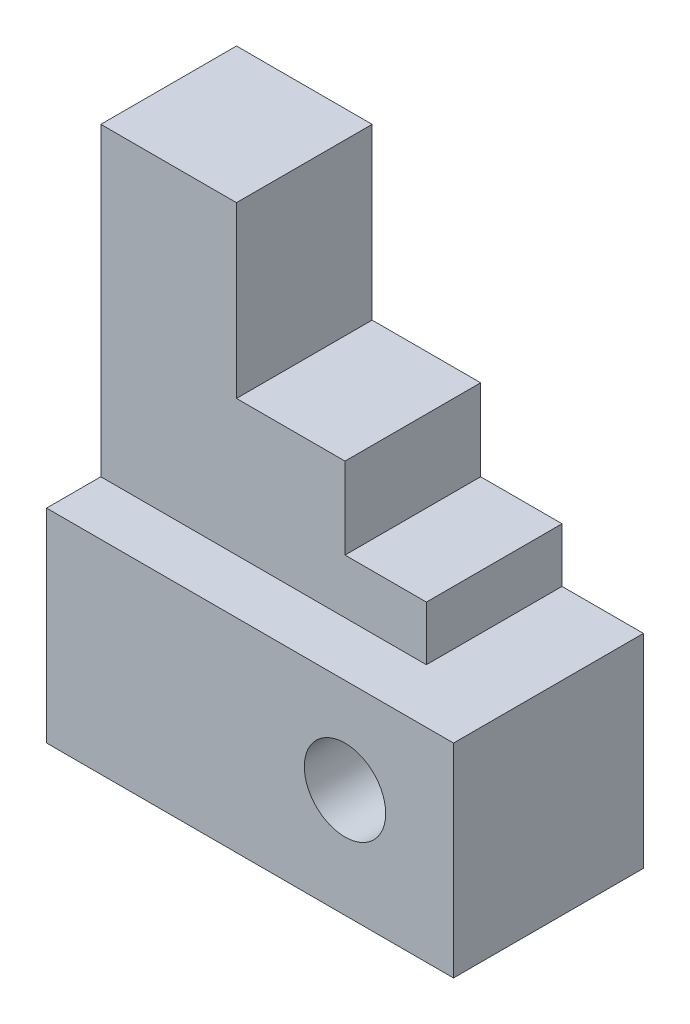
ISO-10303-21;
HEADER;
FILE_DESCRIPTION(('STEP AP214'),'2;1');
FILE_NAME('part.step','',(''),(''),'','','');
FILE_SCHEMA(('AUTOMOTIVE_DESIGN { 1 0 10303 214 1 1 1 1 }'));
ENDSEC;
DATA;
#1=APPLICATION_CONTEXT('core data for automotive mechanical design processes');
#2=APPLICATION_PROTOCOL_DEFINITION('international standard','automotive_design',2000,#1);
#3=PRODUCT_CONTEXT('',#1,'mechanical');
#4=PRODUCT('Part','Part','',(#3));
#5=PRODUCT_RELATED_PRODUCT_CATEGORY('part','',(#4));
#6=PRODUCT_DEFINITION_FORMATION('','',#4);
#7=PRODUCT_DEFINITION_CONTEXT('part definition',#1,'design');
#8=PRODUCT_DEFINITION('design','',#6,#7);
#9=PRODUCT_DEFINITION_SHAPE('','',#8);
#10=(LENGTH_UNIT() NAMED_UNIT(*) SI_UNIT(.MILLI.,.METRE.));
#11=(NAMED_UNIT(*) PLANE_ANGLE_UNIT() SI_UNIT($,.RADIAN.));
#12=(NAMED_UNIT(*) SI_UNIT($,.STERADIAN.) SOLID_ANGLE_UNIT());
#13=UNCERTAINTY_MEASURE_WITH_UNIT(LENGTH_MEASURE(1.E-05),#10,'distance_accuracy_value','');
#14=(GEOMETRIC_REPRESENTATION_CONTEXT(3) GLOBAL_UNCERTAINTY_ASSIGNED_CONTEXT((#13)) GLOBAL_UNIT_ASSIGNED_CONTEXT((#10,
#11,#12)) REPRESENTATION_CONTEXT('',''));
#15=CARTESIAN_POINT('',(0.,0.,0.));
#16=DIRECTION('',(0.,0.,1.));
#17=DIRECTION('',(1.,0.,0.));
#18=AXIS2_PLACEMENT_3D('',#15,#16,#17);
#19=CARTESIAN_POINT('',(30.,30.,-14.));
#20=DIRECTION('',(-1.,0.,0.));
#21=DIRECTION('',(0.,0.,1.));
#22=AXIS2_PLACEMENT_3D('',#19,#20,#21);
#23=PLANE('',#22);
#24=DIRECTION('',(0.,0.,-1.));
#25=VECTOR('',#24,1.);
#26=CARTESIAN_POINT('',(30.,0.,-14.));
#27=LINE('',#26,#25);
#28=CARTESIAN_POINT('',(30.,0.,14.));
#29=VERTEX_POINT('',#28);
#30=CARTESIAN_POINT('',(30.,0.,-14.));
#31=VERTEX_POINT('',#30);
#32=EDGE_CURVE('E219',#29,#31,#27,.T.);
#33=ORIENTED_EDGE('',*,*,#32,.T.);
#34=DIRECTION('',(0.,-1.,0.));
#35=VECTOR('',#34,1.);
#36=CARTESIAN_POINT('',(30.,30.,-14.));
#37=LINE('',#36,#35);
#38=CARTESIAN_POINT('',(30.,30.,-14.));
#39=VERTEX_POINT('',#38);
#40=EDGE_CURVE('E11',#39,#31,#37,.T.);
#41=ORIENTED_EDGE('',*,*,#40,.F.);
#42=DIRECTION('',(0.,0.,-1.));
#43=VECTOR('',#42,1.);
#44=CARTESIAN_POINT('',(30.,30.,-14.));
#45=LINE('',#44,#43);
#46=CARTESIAN_POINT('',(30.,30.,14.));
#47=VERTEX_POINT('',#46);
#48=EDGE_CURVE('E220',#47,#39,#45,.T.);
#49=ORIENTED_EDGE('',*,*,#48,.F.);
#50=DIRECTION('',(0.,-1.,0.));
#51=VECTOR('',#50,1.);
#52=CARTESIAN_POINT('',(30.,30.,14.));
#53=LINE('',#52,#51);
#54=EDGE_CURVE('E233',#47,#29,#53,.T.);
#55=ORIENTED_EDGE('',*,*,#54,.T.);
#56=EDGE_LOOP('',(#33,#41,#49,#55));
#57=FACE_BOUND('',#56,.T.);
#58=ADVANCED_FACE('F43',(#57),#23,.F.);
#59=CARTESIAN_POINT('',(-30.,30.,-14.));
#60=DIRECTION('',(0.,0.,1.));
#61=DIRECTION('',(1.,0.,0.));
#62=AXIS2_PLACEMENT_3D('',#59,#60,#61);
#63=PLANE('',#62);
#64=CARTESIAN_POINT('',(14.,16.,-14.));
#65=DIRECTION('',(0.,0.,1.));
#66=DIRECTION('',(1.,0.,0.));
#67=AXIS2_PLACEMENT_3D('',#64,#65,#66);
#68=CIRCLE('',#67,6.);
#69=CARTESIAN_POINT('',(20.,16.,-14.));
#70=VERTEX_POINT('',#69);
#71=EDGE_CURVE('E215',#70,#70,#68,.T.);
#72=ORIENTED_EDGE('',*,*,#71,.T.);
#73=EDGE_LOOP('',(#72));
#74=FACE_BOUND('',#73,.T.);
#75=DIRECTION('',(-1.,0.,0.));
#76=VECTOR('',#75,1.);
#77=CARTESIAN_POINT('',(-30.,0.,-14.));
#78=LINE('',#77,#76);
#79=CARTESIAN_POINT('',(-30.,0.,-14.));
#80=VERTEX_POINT('',#79);
#81=EDGE_CURVE('E237',#31,#80,#78,.T.);
#82=ORIENTED_EDGE('',*,*,#81,.T.);
#83=DIRECTION('',(0.,-1.,0.));
#84=VECTOR('',#83,1.);
#85=CARTESIAN_POINT('',(-30.,30.,-14.));
#86=LINE('',#85,#84);
#87=CARTESIAN_POINT('',(-30.,75.0000000000001,-14.));
#88=VERTEX_POINT('',#87);
#89=EDGE_CURVE('E51',#88,#80,#86,.T.);
#90=ORIENTED_EDGE('',*,*,#89,.F.);
#91=DIRECTION('',(-1.,0.,0.));
#92=VECTOR('',#91,1.);
#93=CARTESIAN_POINT('',(-30.,75.0000000000001,-14.));
#94=LINE('',#93,#92);
#95=CARTESIAN_POINT('',(-9.99999999999999,75.0000000000001,-14.));
#96=VERTEX_POINT('',#95);
#97=EDGE_CURVE('E154',#96,#88,#94,.T.);
#98=ORIENTED_EDGE('',*,*,#97,.F.);
#99=DIRECTION('',(0.,-1.,0.));
#100=VECTOR('',#99,1.);
#101=CARTESIAN_POINT('',(-9.99999999999999,75.0000000000001,-14.));
#102=LINE('',#101,#100);
#103=CARTESIAN_POINT('',(-9.99999999999999,50.,-14.));
#104=VERTEX_POINT('',#103);
#105=EDGE_CURVE('E163',#96,#104,#102,.T.);
#106=ORIENTED_EDGE('',*,*,#105,.T.);
#107=DIRECTION('',(-1.,0.,0.));
#108=VECTOR('',#107,1.);
#109=CARTESIAN_POINT('',(-30.,50.,-14.));
#110=LINE('',#109,#108);
#111=CARTESIAN_POINT('',(6.00000000000001,50.,-14.));
#112=VERTEX_POINT('',#111);
#113=EDGE_CURVE('E176',#112,#104,#110,.T.);
#114=ORIENTED_EDGE('',*,*,#113,.F.);
#115=DIRECTION('',(0.,-1.,0.));
#116=VECTOR('',#115,1.);
#117=CARTESIAN_POINT('',(6.00000000000001,50.,-14.));
#118=LINE('',#117,#116);
#119=CARTESIAN_POINT('',(6.00000000000001,38.,-14.));
#120=VERTEX_POINT('',#119);
#121=EDGE_CURVE('E179',#112,#120,#118,.T.);
#122=ORIENTED_EDGE('',*,*,#121,.T.);
#123=DIRECTION('',(-1.,0.,0.));
#124=VECTOR('',#123,1.);
#125=CARTESIAN_POINT('',(-30.,38.,-14.));
#126=LINE('',#125,#124);
#127=CARTESIAN_POINT('',(18.,38.,-14.));
#128=VERTEX_POINT('',#127);
#129=EDGE_CURVE('E197',#128,#120,#126,.T.);
#130=ORIENTED_EDGE('',*,*,#129,.F.);
#131=DIRECTION('',(0.,-1.,0.));
#132=VECTOR('',#131,1.);
#133=CARTESIAN_POINT('',(18.,38.,-14.));
#134=LINE('',#133,#132);
#135=CARTESIAN_POINT('',(18.,30.,-14.));
#136=VERTEX_POINT('',#135);
#137=EDGE_CURVE('E200',#128,#136,#134,.T.);
#138=ORIENTED_EDGE('',*,*,#137,.T.);
#139=DIRECTION('',(-1.,0.,0.));
#140=VECTOR('',#139,1.);
#141=CARTESIAN_POINT('',(-30.,30.,-14.));
#142=LINE('',#141,#140);
#143=EDGE_CURVE('E224',#39,#136,#142,.T.);
#144=ORIENTED_EDGE('',*,*,#143,.F.);
#145=ORIENTED_EDGE('',*,*,#40,.T.);
#146=EDGE_LOOP('',(#82,#90,#98,#106,#114,#122,#130,#138,#144,#145));
#147=FACE_BOUND('',#146,.T.);
#148=ADVANCED_FACE('F284',(#74,#147),#63,.F.);
#149=CARTESIAN_POINT('',(-30.,30.,-14.));
#150=DIRECTION('',(1.,0.,0.));
#151=DIRECTION('',(0.,0.,-1.));
#152=AXIS2_PLACEMENT_3D('',#149,#150,#151);
#153=PLANE('',#152);
#154=DIRECTION('',(0.,0.,1.));
#155=VECTOR('',#154,1.);
#156=CARTESIAN_POINT('',(-30.,0.,-14.));
#157=LINE('',#156,#155);
#158=CARTESIAN_POINT('',(-30.,0.,14.));
#159=VERTEX_POINT('',#158);
#160=EDGE_CURVE('E240',#80,#159,#157,.T.);
#161=ORIENTED_EDGE('',*,*,#160,.T.);
#162=DIRECTION('',(0.,-1.,0.));
#163=VECTOR('',#162,1.);
#164=CARTESIAN_POINT('',(-30.,30.,14.));
#165=LINE('',#164,#163);
#166=CARTESIAN_POINT('',(-30.,30.,14.));
#167=VERTEX_POINT('',#166);
#168=EDGE_CURVE('E248',#167,#159,#165,.T.);
#169=ORIENTED_EDGE('',*,*,#168,.F.);
#170=DIRECTION('',(0.,0.,1.));
#171=VECTOR('',#170,1.);
#172=CARTESIAN_POINT('',(-30.,30.,-14.));
#173=LINE('',#172,#171);
#174=CARTESIAN_POINT('',(-30.,30.,6.00000000000001));
#175=VERTEX_POINT('',#174);
#176=EDGE_CURVE('E134',#175,#167,#173,.T.);
#177=ORIENTED_EDGE('',*,*,#176,.F.);
#178=DIRECTION('',(0.,-1.,0.));
#179=VECTOR('',#178,1.);
#180=CARTESIAN_POINT('',(-30.,38.,6.00000000000001));
#181=LINE('',#180,#179);
#182=CARTESIAN_POINT('',(-30.,75.0000000000001,6.00000000000001));
#183=VERTEX_POINT('',#182);
#184=EDGE_CURVE('E127',#183,#175,#181,.T.);
#185=ORIENTED_EDGE('',*,*,#184,.F.);
#186=DIRECTION('',(0.,0.,1.));
#187=VECTOR('',#186,1.);
#188=CARTESIAN_POINT('',(-30.,75.0000000000001,-14.));
#189=LINE('',#188,#187);
#190=EDGE_CURVE('E132',#88,#183,#189,.T.);
#191=ORIENTED_EDGE('',*,*,#190,.F.);
#192=ORIENTED_EDGE('',*,*,#89,.T.);
#193=EDGE_LOOP('',(#161,#169,#177,#185,#191,#192));
#194=FACE_BOUND('',#193,.T.);
#195=ADVANCED_FACE('F129',(#194),#153,.F.);
#196=CARTESIAN_POINT('',(-30.,30.,14.));
#197=DIRECTION('',(0.,0.,-1.));
#198=DIRECTION('',(-1.,0.,0.));
#199=AXIS2_PLACEMENT_3D('',#196,#197,#198);
#200=PLANE('',#199);
#201=CARTESIAN_POINT('',(14.,16.,14.));
#202=DIRECTION('',(0.,0.,1.));
#203=DIRECTION('',(1.,0.,0.));
#204=AXIS2_PLACEMENT_3D('',#201,#202,#203);
#205=CIRCLE('',#204,6.);
#206=CARTESIAN_POINT('',(20.,16.,14.));
#207=VERTEX_POINT('',#206);
#208=EDGE_CURVE('E138',#207,#207,#205,.T.);
#209=ORIENTED_EDGE('',*,*,#208,.F.);
#210=EDGE_LOOP('',(#209));
#211=FACE_BOUND('',#210,.T.);
#212=DIRECTION('',(1.,0.,0.));
#213=VECTOR('',#212,1.);
#214=CARTESIAN_POINT('',(-30.,0.,14.));
#215=LINE('',#214,#213);
#216=EDGE_CURVE('E225',#159,#29,#215,.T.);
#217=ORIENTED_EDGE('',*,*,#216,.T.);
#218=ORIENTED_EDGE('',*,*,#54,.F.);
#219=DIRECTION('',(1.,0.,0.));
#220=VECTOR('',#219,1.);
#221=CARTESIAN_POINT('',(-30.,30.,14.));
#222=LINE('',#221,#220);
#223=EDGE_CURVE('E230',#167,#47,#222,.T.);
#224=ORIENTED_EDGE('',*,*,#223,.F.);
#225=ORIENTED_EDGE('',*,*,#168,.T.);
#226=EDGE_LOOP('',(#217,#218,#224,#225));
#227=FACE_BOUND('',#226,.T.);
#228=ADVANCED_FACE('F260',(#211,#227),#200,.F.);
#229=CARTESIAN_POINT('',(0.,30.,0.));
#230=DIRECTION('',(0.,1.,0.));
#231=DIRECTION('',(0.,0.,1.));
#232=AXIS2_PLACEMENT_3D('',#229,#230,#231);
#233=PLANE('',#232);
#234=DIRECTION('',(0.,0.,-1.));
#235=VECTOR('',#234,1.);
#236=CARTESIAN_POINT('',(18.,30.,-14.));
#237=LINE('',#236,#235);
#238=CARTESIAN_POINT('',(18.,30.,6.00000000000001));
#239=VERTEX_POINT('',#238);
#240=EDGE_CURVE('E194',#239,#136,#237,.T.);
#241=ORIENTED_EDGE('',*,*,#240,.F.);
#242=DIRECTION('',(1.,0.,0.));
#243=VECTOR('',#242,1.);
#244=CARTESIAN_POINT('',(-30.,30.,6.00000000000001));
#245=LINE('',#244,#243);
#246=EDGE_CURVE('E189',#175,#239,#245,.T.);
#247=ORIENTED_EDGE('',*,*,#246,.F.);
#248=ORIENTED_EDGE('',*,*,#176,.T.);
#249=ORIENTED_EDGE('',*,*,#223,.T.);
#250=ORIENTED_EDGE('',*,*,#48,.T.);
#251=ORIENTED_EDGE('',*,*,#143,.T.);
#252=EDGE_LOOP('',(#241,#247,#248,#249,#250,#251));
#253=FACE_BOUND('',#252,.T.);
#254=ADVANCED_FACE('F266',(#253),#233,.T.);
#255=CARTESIAN_POINT('',(0.,0.,0.));
#256=DIRECTION('',(0.,1.,0.));
#257=DIRECTION('',(0.,0.,1.));
#258=AXIS2_PLACEMENT_3D('',#255,#256,#257);
#259=PLANE('',#258);
#260=ORIENTED_EDGE('',*,*,#32,.F.);
#261=ORIENTED_EDGE('',*,*,#216,.F.);
#262=ORIENTED_EDGE('',*,*,#160,.F.);
#263=ORIENTED_EDGE('',*,*,#81,.F.);
#264=EDGE_LOOP('',(#260,#261,#262,#263));
#265=FACE_BOUND('',#264,.T.);
#266=ADVANCED_FACE('F257',(#265),#259,.F.);
#267=CARTESIAN_POINT('',(14.,16.,-33.));
#268=DIRECTION('',(0.,0.,1.));
#269=DIRECTION('',(1.,0.,0.));
#270=AXIS2_PLACEMENT_3D('',#267,#268,#269);
#271=CYLINDRICAL_SURFACE('',#270,6.);
#272=ORIENTED_EDGE('',*,*,#208,.T.);
#273=EDGE_LOOP('',(#272));
#274=FACE_BOUND('',#273,.T.);
#275=ORIENTED_EDGE('',*,*,#71,.F.);
#276=EDGE_LOOP('',(#275));
#277=FACE_BOUND('',#276,.T.);
#278=ADVANCED_FACE('F298',(#274,#277),#271,.F.);
#279=CARTESIAN_POINT('',(-30.,38.,6.00000000000001));
#280=DIRECTION('',(0.,0.,-1.));
#281=DIRECTION('',(-1.,0.,0.));
#282=AXIS2_PLACEMENT_3D('',#279,#280,#281);
#283=PLANE('',#282);
#284=ORIENTED_EDGE('',*,*,#246,.T.);
#285=DIRECTION('',(0.,-1.,0.));
#286=VECTOR('',#285,1.);
#287=CARTESIAN_POINT('',(18.,38.,6.00000000000001));
#288=LINE('',#287,#286);
#289=CARTESIAN_POINT('',(18.,38.,6.00000000000001));
#290=VERTEX_POINT('',#289);
#291=EDGE_CURVE('E139',#290,#239,#288,.T.);
#292=ORIENTED_EDGE('',*,*,#291,.F.);
#293=DIRECTION('',(1.,0.,0.));
#294=VECTOR('',#293,1.);
#295=CARTESIAN_POINT('',(-30.,38.,6.00000000000001));
#296=LINE('',#295,#294);
#297=CARTESIAN_POINT('',(6.,38.,6.00000000000001));
#298=VERTEX_POINT('',#297);
#299=EDGE_CURVE('E190',#298,#290,#296,.T.);
#300=ORIENTED_EDGE('',*,*,#299,.F.);
#301=DIRECTION('',(0.,-1.,0.));
#302=VECTOR('',#301,1.);
#303=CARTESIAN_POINT('',(6.,50.,6.00000000000001));
#304=LINE('',#303,#302);
#305=CARTESIAN_POINT('',(6.,50.,6.00000000000001));
#306=VERTEX_POINT('',#305);
#307=EDGE_CURVE('E185',#306,#298,#304,.T.);
#308=ORIENTED_EDGE('',*,*,#307,.F.);
#309=DIRECTION('',(1.,0.,0.));
#310=VECTOR('',#309,1.);
#311=CARTESIAN_POINT('',(-30.,50.,6.00000000000001));
#312=LINE('',#311,#310);
#313=CARTESIAN_POINT('',(-9.99999999999999,50.,6.00000000000001));
#314=VERTEX_POINT('',#313);
#315=EDGE_CURVE('E170',#314,#306,#312,.T.);
#316=ORIENTED_EDGE('',*,*,#315,.F.);
#317=DIRECTION('',(0.,-1.,0.));
#318=VECTOR('',#317,1.);
#319=CARTESIAN_POINT('',(-9.99999999999999,75.0000000000001,6.00000000000001));
#320=LINE('',#319,#318);
#321=CARTESIAN_POINT('',(-9.99999999999999,75.0000000000001,6.00000000000001));
#322=VERTEX_POINT('',#321);
#323=EDGE_CURVE('E145',#322,#314,#320,.T.);
#324=ORIENTED_EDGE('',*,*,#323,.F.);
#325=DIRECTION('',(1.,0.,0.));
#326=VECTOR('',#325,1.);
#327=CARTESIAN_POINT('',(-30.,75.0000000000001,6.00000000000001));
#328=LINE('',#327,#326);
#329=EDGE_CURVE('E142',#183,#322,#328,.T.);
#330=ORIENTED_EDGE('',*,*,#329,.F.);
#331=ORIENTED_EDGE('',*,*,#184,.T.);
#332=EDGE_LOOP('',(#284,#292,#300,#308,#316,#324,#330,#331));
#333=FACE_BOUND('',#332,.T.);
#334=ADVANCED_FACE('F143',(#333),#283,.F.);
#335=CARTESIAN_POINT('',(18.,38.,-14.));
#336=DIRECTION('',(-1.,0.,0.));
#337=DIRECTION('',(0.,0.,1.));
#338=AXIS2_PLACEMENT_3D('',#335,#336,#337);
#339=PLANE('',#338);
#340=ORIENTED_EDGE('',*,*,#240,.T.);
#341=ORIENTED_EDGE('',*,*,#137,.F.);
#342=DIRECTION('',(0.,0.,-1.));
#343=VECTOR('',#342,1.);
#344=CARTESIAN_POINT('',(18.,38.,-14.));
#345=LINE('',#344,#343);
#346=EDGE_CURVE('E193',#290,#128,#345,.T.);
#347=ORIENTED_EDGE('',*,*,#346,.F.);
#348=ORIENTED_EDGE('',*,*,#291,.T.);
#349=EDGE_LOOP('',(#340,#341,#347,#348));
#350=FACE_BOUND('',#349,.T.);
#351=ADVANCED_FACE('F270',(#350),#339,.F.);
#352=CARTESIAN_POINT('',(0.,38.,0.));
#353=DIRECTION('',(0.,1.,0.));
#354=DIRECTION('',(0.,0.,1.));
#355=AXIS2_PLACEMENT_3D('',#352,#353,#354);
#356=PLANE('',#355);
#357=DIRECTION('',(0.,0.,-1.));
#358=VECTOR('',#357,1.);
#359=CARTESIAN_POINT('',(6.00000000000001,38.,-14.));
#360=LINE('',#359,#358);
#361=EDGE_CURVE('E66',#298,#120,#360,.T.);
#362=ORIENTED_EDGE('',*,*,#361,.F.);
#363=ORIENTED_EDGE('',*,*,#299,.T.);
#364=ORIENTED_EDGE('',*,*,#346,.T.);
#365=ORIENTED_EDGE('',*,*,#129,.T.);
#366=EDGE_LOOP('',(#362,#363,#364,#365));
#367=FACE_BOUND('',#366,.T.);
#368=ADVANCED_FACE('F273',(#367),#356,.T.);
#369=CARTESIAN_POINT('',(6.00000000000001,50.,-14.));
#370=DIRECTION('',(-1.,0.,0.));
#371=DIRECTION('',(0.,0.,1.));
#372=AXIS2_PLACEMENT_3D('',#369,#370,#371);
#373=PLANE('',#372);
#374=ORIENTED_EDGE('',*,*,#361,.T.);
#375=ORIENTED_EDGE('',*,*,#121,.F.);
#376=DIRECTION('',(0.,0.,-1.));
#377=VECTOR('',#376,1.);
#378=CARTESIAN_POINT('',(6.00000000000001,50.,-14.));
#379=LINE('',#378,#377);
#380=EDGE_CURVE('E173',#306,#112,#379,.T.);
#381=ORIENTED_EDGE('',*,*,#380,.F.);
#382=ORIENTED_EDGE('',*,*,#307,.T.);
#383=EDGE_LOOP('',(#374,#375,#381,#382));
#384=FACE_BOUND('',#383,.T.);
#385=ADVANCED_FACE('F277',(#384),#373,.F.);
#386=CARTESIAN_POINT('',(0.,50.,0.));
#387=DIRECTION('',(0.,1.,0.));
#388=DIRECTION('',(0.,0.,1.));
#389=AXIS2_PLACEMENT_3D('',#386,#387,#388);
#390=PLANE('',#389);
#391=DIRECTION('',(0.,0.,-1.));
#392=VECTOR('',#391,1.);
#393=CARTESIAN_POINT('',(-9.99999999999999,50.,-14.));
#394=LINE('',#393,#392);
#395=EDGE_CURVE('E58',#314,#104,#394,.T.);
#396=ORIENTED_EDGE('',*,*,#395,.F.);
#397=ORIENTED_EDGE('',*,*,#315,.T.);
#398=ORIENTED_EDGE('',*,*,#380,.T.);
#399=ORIENTED_EDGE('',*,*,#113,.T.);
#400=EDGE_LOOP('',(#396,#397,#398,#399));
#401=FACE_BOUND('',#400,.T.);
#402=ADVANCED_FACE('F280',(#401),#390,.T.);
#403=CARTESIAN_POINT('',(-9.99999999999999,75.0000000000001,-14.));
#404=DIRECTION('',(-1.,0.,0.));
#405=DIRECTION('',(0.,0.,1.));
#406=AXIS2_PLACEMENT_3D('',#403,#404,#405);
#407=PLANE('',#406);
#408=ORIENTED_EDGE('',*,*,#395,.T.);
#409=ORIENTED_EDGE('',*,*,#105,.F.);
#410=DIRECTION('',(0.,0.,-1.));
#411=VECTOR('',#410,1.);
#412=CARTESIAN_POINT('',(-9.99999999999999,75.0000000000001,-14.));
#413=LINE('',#412,#411);
#414=EDGE_CURVE('E149',#322,#96,#413,.T.);
#415=ORIENTED_EDGE('',*,*,#414,.F.);
#416=ORIENTED_EDGE('',*,*,#323,.T.);
#417=EDGE_LOOP('',(#408,#409,#415,#416));
#418=FACE_BOUND('',#417,.T.);
#419=ADVANCED_FACE('F282',(#418),#407,.F.);
#420=CARTESIAN_POINT('',(0.,75.0000000000001,0.));
#421=DIRECTION('',(0.,1.,0.));
#422=DIRECTION('',(0.,0.,1.));
#423=AXIS2_PLACEMENT_3D('',#420,#421,#422);
#424=PLANE('',#423);
#425=ORIENTED_EDGE('',*,*,#190,.T.);
#426=ORIENTED_EDGE('',*,*,#329,.T.);
#427=ORIENTED_EDGE('',*,*,#414,.T.);
#428=ORIENTED_EDGE('',*,*,#97,.T.);
#429=EDGE_LOOP('',(#425,#426,#427,#428));
#430=FACE_BOUND('',#429,.T.);
#431=ADVANCED_FACE('F152',(#430),#424,.T.);
#432=CLOSED_SHELL('',(#58,#148,#195,#228,#254,#266,#278,#334,#351,#368,#385,#402,#419,#431));
#433=MANIFOLD_SOLID_BREP('B2',#432);
#434=ADVANCED_BREP_SHAPE_REPRESENTATION('',(#18,#433),#14);
#435=SHAPE_DEFINITION_REPRESENTATION(#9,#434);
ENDSEC;
END-ISO-10303-21;
